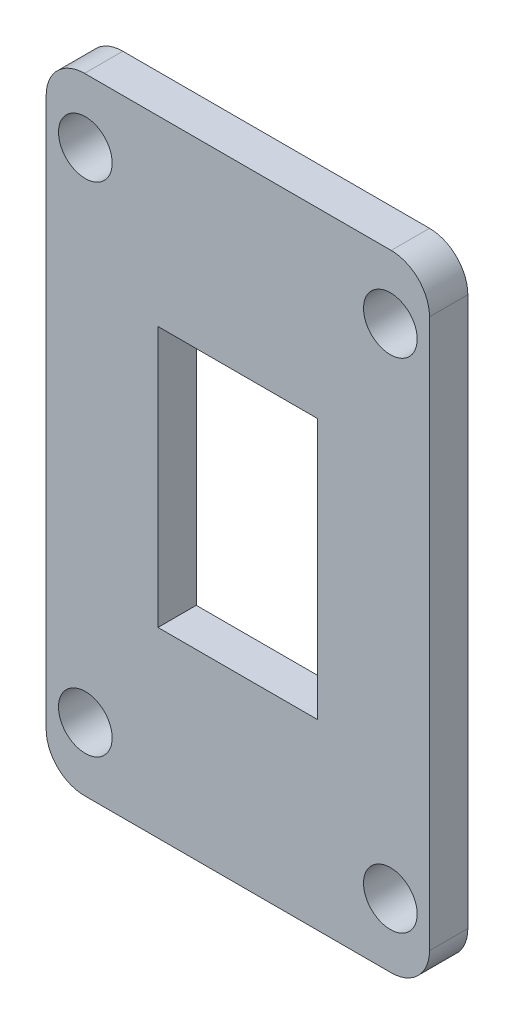
ISO-10303-21;
HEADER;
FILE_DESCRIPTION(('STEP AP214'),'2;1');
FILE_NAME('part.step','',(''),(''),'','','');
FILE_SCHEMA(('AUTOMOTIVE_DESIGN { 1 0 10303 214 1 1 1 1 }'));
ENDSEC;
DATA;
#1=APPLICATION_CONTEXT('core data for automotive mechanical design processes');
#2=APPLICATION_PROTOCOL_DEFINITION('international standard','automotive_design',2000,#1);
#3=PRODUCT_CONTEXT('',#1,'mechanical');
#4=PRODUCT('Part','Part','',(#3));
#5=PRODUCT_RELATED_PRODUCT_CATEGORY('part','',(#4));
#6=PRODUCT_DEFINITION_FORMATION('','',#4);
#7=PRODUCT_DEFINITION_CONTEXT('part definition',#1,'design');
#8=PRODUCT_DEFINITION('design','',#6,#7);
#9=PRODUCT_DEFINITION_SHAPE('','',#8);
#10=(LENGTH_UNIT() NAMED_UNIT(*) SI_UNIT(.MILLI.,.METRE.));
#11=(NAMED_UNIT(*) PLANE_ANGLE_UNIT() SI_UNIT($,.RADIAN.));
#12=(NAMED_UNIT(*) SI_UNIT($,.STERADIAN.) SOLID_ANGLE_UNIT());
#13=UNCERTAINTY_MEASURE_WITH_UNIT(LENGTH_MEASURE(1.E-05),#10,'distance_accuracy_value','');
#14=(GEOMETRIC_REPRESENTATION_CONTEXT(3) GLOBAL_UNCERTAINTY_ASSIGNED_CONTEXT((#13)) GLOBAL_UNIT_ASSIGNED_CONTEXT((#10,
#11,#12)) REPRESENTATION_CONTEXT('',''));
#15=CARTESIAN_POINT('',(0.,0.,0.));
#16=DIRECTION('',(0.,0.,1.));
#17=DIRECTION('',(1.,0.,0.));
#18=AXIS2_PLACEMENT_3D('',#15,#16,#17);
#19=CARTESIAN_POINT('',(0.,0.,3.));
#20=DIRECTION('',(0.,0.,1.));
#21=DIRECTION('',(1.,0.,0.));
#22=AXIS2_PLACEMENT_3D('',#19,#20,#21);
#23=PLANE('',#22);
#24=CARTESIAN_POINT('',(11.9362745098039,-19.48,3.));
#25=DIRECTION('',(0.,0.,1.));
#26=DIRECTION('',(1.,0.,0.));
#27=AXIS2_PLACEMENT_3D('',#24,#25,#26);
#28=CIRCLE('',#27,2.1);
#29=CARTESIAN_POINT('',(14.0362745098039,-19.48,3.));
#30=VERTEX_POINT('',#29);
#31=EDGE_CURVE('E425',#30,#30,#28,.T.);
#32=ORIENTED_EDGE('',*,*,#31,.F.);
#33=EDGE_LOOP('',(#32));
#34=FACE_BOUND('',#33,.T.);
#35=CARTESIAN_POINT('',(-11.9362745098039,19.48,3.));
#36=DIRECTION('',(0.,0.,1.));
#37=DIRECTION('',(1.,0.,0.));
#38=AXIS2_PLACEMENT_3D('',#35,#36,#37);
#39=CIRCLE('',#38,2.1);
#40=CARTESIAN_POINT('',(-9.83627450980392,19.48,3.));
#41=VERTEX_POINT('',#40);
#42=EDGE_CURVE('E157',#41,#41,#39,.T.);
#43=ORIENTED_EDGE('',*,*,#42,.F.);
#44=EDGE_LOOP('',(#43));
#45=FACE_BOUND('',#44,.T.);
#46=DIRECTION('',(-1.,0.,0.));
#47=VECTOR('',#46,1.);
#48=CARTESIAN_POINT('',(-15.,24.48,3.));
#49=LINE('',#48,#47);
#50=CARTESIAN_POINT('',(12.,24.48,3.));
#51=VERTEX_POINT('',#50);
#52=CARTESIAN_POINT('',(-12.,24.48,3.));
#53=VERTEX_POINT('',#52);
#54=EDGE_CURVE('E171',#51,#53,#49,.T.);
#55=ORIENTED_EDGE('',*,*,#54,.T.);
#56=CARTESIAN_POINT('',(-12.,21.48,3.));
#57=DIRECTION('',(0.,0.,1.));
#58=DIRECTION('',(1.,0.,0.));
#59=AXIS2_PLACEMENT_3D('',#56,#57,#58);
#60=CIRCLE('',#59,3.);
#61=CARTESIAN_POINT('',(-15.,21.48,3.));
#62=VERTEX_POINT('',#61);
#63=EDGE_CURVE('E211',#53,#62,#60,.T.);
#64=ORIENTED_EDGE('',*,*,#63,.T.);
#65=DIRECTION('',(0.,-1.,0.));
#66=VECTOR('',#65,1.);
#67=CARTESIAN_POINT('',(-15.,24.48,3.));
#68=LINE('',#67,#66);
#69=CARTESIAN_POINT('',(-15.,-21.48,3.));
#70=VERTEX_POINT('',#69);
#71=EDGE_CURVE('E175',#62,#70,#68,.T.);
#72=ORIENTED_EDGE('',*,*,#71,.T.);
#73=CARTESIAN_POINT('',(-12.,-21.48,3.));
#74=DIRECTION('',(0.,0.,1.));
#75=DIRECTION('',(1.,0.,0.));
#76=AXIS2_PLACEMENT_3D('',#73,#74,#75);
#77=CIRCLE('',#76,3.);
#78=CARTESIAN_POINT('',(-12.,-24.48,3.));
#79=VERTEX_POINT('',#78);
#80=EDGE_CURVE('E54',#70,#79,#77,.T.);
#81=ORIENTED_EDGE('',*,*,#80,.T.);
#82=DIRECTION('',(1.,0.,0.));
#83=VECTOR('',#82,1.);
#84=CARTESIAN_POINT('',(-15.,-24.48,3.));
#85=LINE('',#84,#83);
#86=CARTESIAN_POINT('',(12.,-24.48,3.));
#87=VERTEX_POINT('',#86);
#88=EDGE_CURVE('E177',#79,#87,#85,.T.);
#89=ORIENTED_EDGE('',*,*,#88,.T.);
#90=CARTESIAN_POINT('',(12.,-21.48,3.));
#91=DIRECTION('',(0.,0.,1.));
#92=DIRECTION('',(1.,0.,0.));
#93=AXIS2_PLACEMENT_3D('',#90,#91,#92);
#94=CIRCLE('',#93,3.);
#95=CARTESIAN_POINT('',(15.,-21.48,3.));
#96=VERTEX_POINT('',#95);
#97=EDGE_CURVE('E208',#87,#96,#94,.T.);
#98=ORIENTED_EDGE('',*,*,#97,.T.);
#99=DIRECTION('',(0.,1.,0.));
#100=VECTOR('',#99,1.);
#101=CARTESIAN_POINT('',(15.,24.48,3.));
#102=LINE('',#101,#100);
#103=CARTESIAN_POINT('',(15.,21.48,3.));
#104=VERTEX_POINT('',#103);
#105=EDGE_CURVE('E168',#96,#104,#102,.T.);
#106=ORIENTED_EDGE('',*,*,#105,.T.);
#107=CARTESIAN_POINT('',(12.,21.48,3.));
#108=DIRECTION('',(0.,0.,1.));
#109=DIRECTION('',(1.,0.,0.));
#110=AXIS2_PLACEMENT_3D('',#107,#108,#109);
#111=CIRCLE('',#110,3.);
#112=EDGE_CURVE('E206',#104,#51,#111,.T.);
#113=ORIENTED_EDGE('',*,*,#112,.T.);
#114=EDGE_LOOP('',(#55,#64,#72,#81,#89,#98,#106,#113));
#115=FACE_BOUND('',#114,.T.);
#116=DIRECTION('',(-1.,0.,0.));
#117=VECTOR('',#116,1.);
#118=CARTESIAN_POINT('',(-6.24999999999999,10.2,3.));
#119=LINE('',#118,#117);
#120=CARTESIAN_POINT('',(6.25000000000001,10.2,3.));
#121=VERTEX_POINT('',#120);
#122=CARTESIAN_POINT('',(-6.24999999999999,10.2,3.));
#123=VERTEX_POINT('',#122);
#124=EDGE_CURVE('E134',#121,#123,#119,.T.);
#125=ORIENTED_EDGE('',*,*,#124,.F.);
#126=DIRECTION('',(0.,1.,0.));
#127=VECTOR('',#126,1.);
#128=CARTESIAN_POINT('',(6.25000000000001,10.2,3.));
#129=LINE('',#128,#127);
#130=CARTESIAN_POINT('',(6.25000000000001,-10.2,3.));
#131=VERTEX_POINT('',#130);
#132=EDGE_CURVE('E124',#131,#121,#129,.T.);
#133=ORIENTED_EDGE('',*,*,#132,.F.);
#134=DIRECTION('',(1.,0.,0.));
#135=VECTOR('',#134,1.);
#136=CARTESIAN_POINT('',(-6.24999999999999,-10.2,3.));
#137=LINE('',#136,#135);
#138=CARTESIAN_POINT('',(-6.24999999999999,-10.2,3.));
#139=VERTEX_POINT('',#138);
#140=EDGE_CURVE('E150',#139,#131,#137,.T.);
#141=ORIENTED_EDGE('',*,*,#140,.F.);
#142=DIRECTION('',(0.,-1.,0.));
#143=VECTOR('',#142,1.);
#144=CARTESIAN_POINT('',(-6.24999999999999,10.2,3.));
#145=LINE('',#144,#143);
#146=EDGE_CURVE('E148',#123,#139,#145,.T.);
#147=ORIENTED_EDGE('',*,*,#146,.F.);
#148=EDGE_LOOP('',(#125,#133,#141,#147));
#149=FACE_BOUND('',#148,.T.);
#150=CARTESIAN_POINT('',(11.9362745098039,19.48,3.));
#151=DIRECTION('',(0.,0.,1.));
#152=DIRECTION('',(1.,0.,0.));
#153=AXIS2_PLACEMENT_3D('',#150,#151,#152);
#154=CIRCLE('',#153,2.1);
#155=CARTESIAN_POINT('',(14.0362745098039,19.48,3.));
#156=VERTEX_POINT('',#155);
#157=EDGE_CURVE('E430',#156,#156,#154,.T.);
#158=ORIENTED_EDGE('',*,*,#157,.F.);
#159=EDGE_LOOP('',(#158));
#160=FACE_BOUND('',#159,.T.);
#161=CARTESIAN_POINT('',(-11.9362745098039,-19.48,3.));
#162=DIRECTION('',(0.,0.,1.));
#163=DIRECTION('',(1.,0.,0.));
#164=AXIS2_PLACEMENT_3D('',#161,#162,#163);
#165=CIRCLE('',#164,2.09999999999999);
#166=CARTESIAN_POINT('',(-9.83627450980392,-19.48,3.));
#167=VERTEX_POINT('',#166);
#168=EDGE_CURVE('E420',#167,#167,#165,.T.);
#169=ORIENTED_EDGE('',*,*,#168,.F.);
#170=EDGE_LOOP('',(#169));
#171=FACE_BOUND('',#170,.T.);
#172=ADVANCED_FACE('F32',(#34,#45,#115,#149,#160,#171),#23,.T.);
#173=CARTESIAN_POINT('',(0.,0.,0.));
#174=DIRECTION('',(0.,0.,1.));
#175=DIRECTION('',(1.,0.,0.));
#176=AXIS2_PLACEMENT_3D('',#173,#174,#175);
#177=PLANE('',#176);
#178=CARTESIAN_POINT('',(11.9362745098039,-19.48,0.));
#179=DIRECTION('',(0.,0.,1.));
#180=DIRECTION('',(1.,0.,0.));
#181=AXIS2_PLACEMENT_3D('',#178,#179,#180);
#182=CIRCLE('',#181,2.1);
#183=CARTESIAN_POINT('',(14.0362745098039,-19.48,0.));
#184=VERTEX_POINT('',#183);
#185=EDGE_CURVE('E422',#184,#184,#182,.T.);
#186=ORIENTED_EDGE('',*,*,#185,.T.);
#187=EDGE_LOOP('',(#186));
#188=FACE_BOUND('',#187,.T.);
#189=CARTESIAN_POINT('',(-11.9362745098039,19.48,0.));
#190=DIRECTION('',(0.,0.,1.));
#191=DIRECTION('',(1.,0.,0.));
#192=AXIS2_PLACEMENT_3D('',#189,#190,#191);
#193=CIRCLE('',#192,2.1);
#194=CARTESIAN_POINT('',(-9.83627450980392,19.48,0.));
#195=VERTEX_POINT('',#194);
#196=EDGE_CURVE('E433',#195,#195,#193,.T.);
#197=ORIENTED_EDGE('',*,*,#196,.T.);
#198=EDGE_LOOP('',(#197));
#199=FACE_BOUND('',#198,.T.);
#200=DIRECTION('',(0.,-1.,0.));
#201=VECTOR('',#200,1.);
#202=CARTESIAN_POINT('',(-15.,24.48,0.));
#203=LINE('',#202,#201);
#204=CARTESIAN_POINT('',(-15.,21.48,0.));
#205=VERTEX_POINT('',#204);
#206=CARTESIAN_POINT('',(-15.,-21.48,0.));
#207=VERTEX_POINT('',#206);
#208=EDGE_CURVE('E185',#205,#207,#203,.T.);
#209=ORIENTED_EDGE('',*,*,#208,.F.);
#210=CARTESIAN_POINT('',(-12.,21.48,0.));
#211=DIRECTION('',(0.,0.,1.));
#212=DIRECTION('',(1.,0.,0.));
#213=AXIS2_PLACEMENT_3D('',#210,#211,#212);
#214=CIRCLE('',#213,3.);
#215=CARTESIAN_POINT('',(-12.,24.48,0.));
#216=VERTEX_POINT('',#215);
#217=EDGE_CURVE('E199',#205,#216,#214,.F.);
#218=ORIENTED_EDGE('',*,*,#217,.T.);
#219=DIRECTION('',(-1.,0.,0.));
#220=VECTOR('',#219,1.);
#221=CARTESIAN_POINT('',(-15.,24.48,0.));
#222=LINE('',#221,#220);
#223=CARTESIAN_POINT('',(12.,24.48,0.));
#224=VERTEX_POINT('',#223);
#225=EDGE_CURVE('E182',#224,#216,#222,.T.);
#226=ORIENTED_EDGE('',*,*,#225,.F.);
#227=CARTESIAN_POINT('',(12.,21.48,0.));
#228=DIRECTION('',(0.,0.,1.));
#229=DIRECTION('',(1.,0.,0.));
#230=AXIS2_PLACEMENT_3D('',#227,#228,#229);
#231=CIRCLE('',#230,3.);
#232=CARTESIAN_POINT('',(15.,21.48,0.));
#233=VERTEX_POINT('',#232);
#234=EDGE_CURVE('E193',#224,#233,#231,.F.);
#235=ORIENTED_EDGE('',*,*,#234,.T.);
#236=DIRECTION('',(0.,1.,0.));
#237=VECTOR('',#236,1.);
#238=CARTESIAN_POINT('',(15.,24.48,0.));
#239=LINE('',#238,#237);
#240=CARTESIAN_POINT('',(15.,-21.48,0.));
#241=VERTEX_POINT('',#240);
#242=EDGE_CURVE('E142',#241,#233,#239,.T.);
#243=ORIENTED_EDGE('',*,*,#242,.F.);
#244=CARTESIAN_POINT('',(12.,-21.48,0.));
#245=DIRECTION('',(0.,0.,1.));
#246=DIRECTION('',(1.,0.,0.));
#247=AXIS2_PLACEMENT_3D('',#244,#245,#246);
#248=CIRCLE('',#247,3.);
#249=CARTESIAN_POINT('',(12.,-24.48,0.));
#250=VERTEX_POINT('',#249);
#251=EDGE_CURVE('E195',#241,#250,#248,.F.);
#252=ORIENTED_EDGE('',*,*,#251,.T.);
#253=DIRECTION('',(1.,0.,0.));
#254=VECTOR('',#253,1.);
#255=CARTESIAN_POINT('',(-15.,-24.48,0.));
#256=LINE('',#255,#254);
#257=CARTESIAN_POINT('',(-12.,-24.48,0.));
#258=VERTEX_POINT('',#257);
#259=EDGE_CURVE('E172',#258,#250,#256,.T.);
#260=ORIENTED_EDGE('',*,*,#259,.F.);
#261=CARTESIAN_POINT('',(-12.,-21.48,0.));
#262=DIRECTION('',(0.,0.,1.));
#263=DIRECTION('',(1.,0.,0.));
#264=AXIS2_PLACEMENT_3D('',#261,#262,#263);
#265=CIRCLE('',#264,3.);
#266=EDGE_CURVE('E197',#258,#207,#265,.F.);
#267=ORIENTED_EDGE('',*,*,#266,.T.);
#268=EDGE_LOOP('',(#209,#218,#226,#235,#243,#252,#260,#267));
#269=FACE_BOUND('',#268,.T.);
#270=DIRECTION('',(0.,1.,0.));
#271=VECTOR('',#270,1.);
#272=CARTESIAN_POINT('',(6.25000000000001,10.2,0.));
#273=LINE('',#272,#271);
#274=CARTESIAN_POINT('',(6.25000000000001,-10.2,0.));
#275=VERTEX_POINT('',#274);
#276=CARTESIAN_POINT('',(6.25000000000001,10.2,0.));
#277=VERTEX_POINT('',#276);
#278=EDGE_CURVE('E155',#275,#277,#273,.T.);
#279=ORIENTED_EDGE('',*,*,#278,.T.);
#280=DIRECTION('',(-1.,0.,0.));
#281=VECTOR('',#280,1.);
#282=CARTESIAN_POINT('',(-6.24999999999999,10.2,0.));
#283=LINE('',#282,#281);
#284=CARTESIAN_POINT('',(-6.24999999999999,10.2,0.));
#285=VERTEX_POINT('',#284);
#286=EDGE_CURVE('E141',#277,#285,#283,.T.);
#287=ORIENTED_EDGE('',*,*,#286,.T.);
#288=DIRECTION('',(0.,-1.,0.));
#289=VECTOR('',#288,1.);
#290=CARTESIAN_POINT('',(-6.24999999999999,10.2,0.));
#291=LINE('',#290,#289);
#292=CARTESIAN_POINT('',(-6.24999999999999,-10.2,0.));
#293=VERTEX_POINT('',#292);
#294=EDGE_CURVE('E159',#285,#293,#291,.T.);
#295=ORIENTED_EDGE('',*,*,#294,.T.);
#296=DIRECTION('',(1.,0.,0.));
#297=VECTOR('',#296,1.);
#298=CARTESIAN_POINT('',(-6.24999999999999,-10.2,0.));
#299=LINE('',#298,#297);
#300=EDGE_CURVE('E135',#293,#275,#299,.T.);
#301=ORIENTED_EDGE('',*,*,#300,.T.);
#302=EDGE_LOOP('',(#279,#287,#295,#301));
#303=FACE_BOUND('',#302,.T.);
#304=CARTESIAN_POINT('',(11.9362745098039,19.48,0.));
#305=DIRECTION('',(0.,0.,1.));
#306=DIRECTION('',(1.,0.,0.));
#307=AXIS2_PLACEMENT_3D('',#304,#305,#306);
#308=CIRCLE('',#307,2.1);
#309=CARTESIAN_POINT('',(14.0362745098039,19.48,0.));
#310=VERTEX_POINT('',#309);
#311=EDGE_CURVE('E416',#310,#310,#308,.T.);
#312=ORIENTED_EDGE('',*,*,#311,.T.);
#313=EDGE_LOOP('',(#312));
#314=FACE_BOUND('',#313,.T.);
#315=CARTESIAN_POINT('',(-11.9362745098039,-19.48,0.));
#316=DIRECTION('',(0.,0.,1.));
#317=DIRECTION('',(1.,0.,0.));
#318=AXIS2_PLACEMENT_3D('',#315,#316,#317);
#319=CIRCLE('',#318,2.09999999999999);
#320=CARTESIAN_POINT('',(-9.83627450980392,-19.48,0.));
#321=VERTEX_POINT('',#320);
#322=EDGE_CURVE('E419',#321,#321,#319,.T.);
#323=ORIENTED_EDGE('',*,*,#322,.T.);
#324=EDGE_LOOP('',(#323));
#325=FACE_BOUND('',#324,.T.);
#326=ADVANCED_FACE('F233',(#188,#199,#269,#303,#314,#325),#177,.F.);
#327=CARTESIAN_POINT('',(15.,24.48,3.));
#328=DIRECTION('',(-1.,0.,0.));
#329=DIRECTION('',(0.,0.,1.));
#330=AXIS2_PLACEMENT_3D('',#327,#328,#329);
#331=PLANE('',#330);
#332=ORIENTED_EDGE('',*,*,#105,.F.);
#333=DIRECTION('',(0.,0.,-1.));
#334=VECTOR('',#333,1.);
#335=CARTESIAN_POINT('',(15.,-21.48,3.));
#336=LINE('',#335,#334);
#337=EDGE_CURVE('E11',#96,#241,#336,.T.);
#338=ORIENTED_EDGE('',*,*,#337,.T.);
#339=ORIENTED_EDGE('',*,*,#242,.T.);
#340=DIRECTION('',(0.,0.,-1.));
#341=VECTOR('',#340,1.);
#342=CARTESIAN_POINT('',(15.,21.48,3.));
#343=LINE('',#342,#341);
#344=EDGE_CURVE('E40',#233,#104,#343,.F.);
#345=ORIENTED_EDGE('',*,*,#344,.T.);
#346=EDGE_LOOP('',(#332,#338,#339,#345));
#347=FACE_BOUND('',#346,.T.);
#348=ADVANCED_FACE('F219',(#347),#331,.F.);
#349=CARTESIAN_POINT('',(-15.,24.48,3.));
#350=DIRECTION('',(0.,-1.,0.));
#351=DIRECTION('',(0.,0.,-1.));
#352=AXIS2_PLACEMENT_3D('',#349,#350,#351);
#353=PLANE('',#352);
#354=ORIENTED_EDGE('',*,*,#225,.T.);
#355=DIRECTION('',(0.,0.,-1.));
#356=VECTOR('',#355,1.);
#357=CARTESIAN_POINT('',(-12.,24.48,3.));
#358=LINE('',#357,#356);
#359=EDGE_CURVE('E204',#216,#53,#358,.F.);
#360=ORIENTED_EDGE('',*,*,#359,.T.);
#361=ORIENTED_EDGE('',*,*,#54,.F.);
#362=DIRECTION('',(0.,0.,-1.));
#363=VECTOR('',#362,1.);
#364=CARTESIAN_POINT('',(12.,24.48,3.));
#365=LINE('',#364,#363);
#366=EDGE_CURVE('E201',#51,#224,#365,.T.);
#367=ORIENTED_EDGE('',*,*,#366,.T.);
#368=EDGE_LOOP('',(#354,#360,#361,#367));
#369=FACE_BOUND('',#368,.T.);
#370=ADVANCED_FACE('F229',(#369),#353,.F.);
#371=CARTESIAN_POINT('',(-15.,24.48,3.));
#372=DIRECTION('',(1.,0.,0.));
#373=DIRECTION('',(0.,0.,-1.));
#374=AXIS2_PLACEMENT_3D('',#371,#372,#373);
#375=PLANE('',#374);
#376=ORIENTED_EDGE('',*,*,#71,.F.);
#377=DIRECTION('',(0.,0.,-1.));
#378=VECTOR('',#377,1.);
#379=CARTESIAN_POINT('',(-15.,21.48,3.));
#380=LINE('',#379,#378);
#381=EDGE_CURVE('E190',#62,#205,#380,.T.);
#382=ORIENTED_EDGE('',*,*,#381,.T.);
#383=ORIENTED_EDGE('',*,*,#208,.T.);
#384=DIRECTION('',(0.,0.,-1.));
#385=VECTOR('',#384,1.);
#386=CARTESIAN_POINT('',(-15.,-21.48,3.));
#387=LINE('',#386,#385);
#388=EDGE_CURVE('E179',#207,#70,#387,.F.);
#389=ORIENTED_EDGE('',*,*,#388,.T.);
#390=EDGE_LOOP('',(#376,#382,#383,#389));
#391=FACE_BOUND('',#390,.T.);
#392=ADVANCED_FACE('F241',(#391),#375,.F.);
#393=CARTESIAN_POINT('',(-15.,-24.48,3.));
#394=DIRECTION('',(0.,1.,0.));
#395=DIRECTION('',(0.,0.,1.));
#396=AXIS2_PLACEMENT_3D('',#393,#394,#395);
#397=PLANE('',#396);
#398=ORIENTED_EDGE('',*,*,#88,.F.);
#399=DIRECTION('',(0.,0.,-1.));
#400=VECTOR('',#399,1.);
#401=CARTESIAN_POINT('',(-12.,-24.48,3.));
#402=LINE('',#401,#400);
#403=EDGE_CURVE('E214',#79,#258,#402,.T.);
#404=ORIENTED_EDGE('',*,*,#403,.T.);
#405=ORIENTED_EDGE('',*,*,#259,.T.);
#406=DIRECTION('',(0.,0.,-1.));
#407=VECTOR('',#406,1.);
#408=CARTESIAN_POINT('',(12.,-24.48,3.));
#409=LINE('',#408,#407);
#410=EDGE_CURVE('E47',#250,#87,#409,.F.);
#411=ORIENTED_EDGE('',*,*,#410,.T.);
#412=EDGE_LOOP('',(#398,#404,#405,#411));
#413=FACE_BOUND('',#412,.T.);
#414=ADVANCED_FACE('F247',(#413),#397,.F.);
#415=CARTESIAN_POINT('',(6.25000000000001,10.2,3.));
#416=DIRECTION('',(-1.,0.,0.));
#417=DIRECTION('',(0.,0.,1.));
#418=AXIS2_PLACEMENT_3D('',#415,#416,#417);
#419=PLANE('',#418);
#420=ORIENTED_EDGE('',*,*,#278,.F.);
#421=DIRECTION('',(0.,0.,-1.));
#422=VECTOR('',#421,1.);
#423=CARTESIAN_POINT('',(6.25000000000001,-10.2,3.));
#424=LINE('',#423,#422);
#425=EDGE_CURVE('E130',#131,#275,#424,.T.);
#426=ORIENTED_EDGE('',*,*,#425,.F.);
#427=ORIENTED_EDGE('',*,*,#132,.T.);
#428=DIRECTION('',(0.,0.,-1.));
#429=VECTOR('',#428,1.);
#430=CARTESIAN_POINT('',(6.25000000000001,10.2,3.));
#431=LINE('',#430,#429);
#432=EDGE_CURVE('E127',#121,#277,#431,.T.);
#433=ORIENTED_EDGE('',*,*,#432,.T.);
#434=EDGE_LOOP('',(#420,#426,#427,#433));
#435=FACE_BOUND('',#434,.T.);
#436=ADVANCED_FACE('F126',(#435),#419,.T.);
#437=CARTESIAN_POINT('',(-6.24999999999999,10.2,3.));
#438=DIRECTION('',(0.,-1.,0.));
#439=DIRECTION('',(0.,0.,-1.));
#440=AXIS2_PLACEMENT_3D('',#437,#438,#439);
#441=PLANE('',#440);
#442=ORIENTED_EDGE('',*,*,#286,.F.);
#443=ORIENTED_EDGE('',*,*,#432,.F.);
#444=ORIENTED_EDGE('',*,*,#124,.T.);
#445=DIRECTION('',(0.,0.,-1.));
#446=VECTOR('',#445,1.);
#447=CARTESIAN_POINT('',(-6.24999999999999,10.2,3.));
#448=LINE('',#447,#446);
#449=EDGE_CURVE('E143',#123,#285,#448,.T.);
#450=ORIENTED_EDGE('',*,*,#449,.T.);
#451=EDGE_LOOP('',(#442,#443,#444,#450));
#452=FACE_BOUND('',#451,.T.);
#453=ADVANCED_FACE('F138',(#452),#441,.T.);
#454=CARTESIAN_POINT('',(-6.24999999999999,10.2,3.));
#455=DIRECTION('',(1.,0.,0.));
#456=DIRECTION('',(0.,1.,0.));
#457=AXIS2_PLACEMENT_3D('',#454,#455,#456);
#458=PLANE('',#457);
#459=ORIENTED_EDGE('',*,*,#294,.F.);
#460=ORIENTED_EDGE('',*,*,#449,.F.);
#461=ORIENTED_EDGE('',*,*,#146,.T.);
#462=DIRECTION('',(0.,0.,-1.));
#463=VECTOR('',#462,1.);
#464=CARTESIAN_POINT('',(-6.24999999999999,-10.2,3.));
#465=LINE('',#464,#463);
#466=EDGE_CURVE('E165',#139,#293,#465,.T.);
#467=ORIENTED_EDGE('',*,*,#466,.T.);
#468=EDGE_LOOP('',(#459,#460,#461,#467));
#469=FACE_BOUND('',#468,.T.);
#470=ADVANCED_FACE('F304',(#469),#458,.T.);
#471=CARTESIAN_POINT('',(-6.24999999999999,-10.2,3.));
#472=DIRECTION('',(0.,1.,0.));
#473=DIRECTION('',(0.,0.,1.));
#474=AXIS2_PLACEMENT_3D('',#471,#472,#473);
#475=PLANE('',#474);
#476=ORIENTED_EDGE('',*,*,#300,.F.);
#477=ORIENTED_EDGE('',*,*,#466,.F.);
#478=ORIENTED_EDGE('',*,*,#140,.T.);
#479=ORIENTED_EDGE('',*,*,#425,.T.);
#480=EDGE_LOOP('',(#476,#477,#478,#479));
#481=FACE_BOUND('',#480,.T.);
#482=ADVANCED_FACE('F300',(#481),#475,.T.);
#483=CARTESIAN_POINT('',(-11.9362745098039,19.48,3.));
#484=DIRECTION('',(0.,0.,-1.));
#485=DIRECTION('',(-1.,0.,0.));
#486=AXIS2_PLACEMENT_3D('',#483,#484,#485);
#487=CYLINDRICAL_SURFACE('',#486,2.1);
#488=ORIENTED_EDGE('',*,*,#42,.T.);
#489=EDGE_LOOP('',(#488));
#490=FACE_BOUND('',#489,.T.);
#491=ORIENTED_EDGE('',*,*,#196,.F.);
#492=EDGE_LOOP('',(#491));
#493=FACE_BOUND('',#492,.T.);
#494=ADVANCED_FACE('F296',(#490,#493),#487,.F.);
#495=CARTESIAN_POINT('',(11.9362745098039,19.48,3.));
#496=DIRECTION('',(0.,0.,-1.));
#497=DIRECTION('',(-1.,0.,0.));
#498=AXIS2_PLACEMENT_3D('',#495,#496,#497);
#499=CYLINDRICAL_SURFACE('',#498,2.1);
#500=ORIENTED_EDGE('',*,*,#157,.T.);
#501=EDGE_LOOP('',(#500));
#502=FACE_BOUND('',#501,.T.);
#503=ORIENTED_EDGE('',*,*,#311,.F.);
#504=EDGE_LOOP('',(#503));
#505=FACE_BOUND('',#504,.T.);
#506=ADVANCED_FACE('F288',(#502,#505),#499,.F.);
#507=CARTESIAN_POINT('',(11.9362745098039,-19.48,3.));
#508=DIRECTION('',(0.,0.,-1.));
#509=DIRECTION('',(-1.,0.,0.));
#510=AXIS2_PLACEMENT_3D('',#507,#508,#509);
#511=CYLINDRICAL_SURFACE('',#510,2.1);
#512=ORIENTED_EDGE('',*,*,#31,.T.);
#513=EDGE_LOOP('',(#512));
#514=FACE_BOUND('',#513,.T.);
#515=ORIENTED_EDGE('',*,*,#185,.F.);
#516=EDGE_LOOP('',(#515));
#517=FACE_BOUND('',#516,.T.);
#518=ADVANCED_FACE('F282',(#514,#517),#511,.F.);
#519=CARTESIAN_POINT('',(-11.9362745098039,-19.48,3.));
#520=DIRECTION('',(0.,0.,-1.));
#521=DIRECTION('',(-1.,0.,0.));
#522=AXIS2_PLACEMENT_3D('',#519,#520,#521);
#523=CYLINDRICAL_SURFACE('',#522,2.09999999999999);
#524=ORIENTED_EDGE('',*,*,#168,.T.);
#525=EDGE_LOOP('',(#524));
#526=FACE_BOUND('',#525,.T.);
#527=ORIENTED_EDGE('',*,*,#322,.F.);
#528=EDGE_LOOP('',(#527));
#529=FACE_BOUND('',#528,.T.);
#530=ADVANCED_FACE('F278',(#526,#529),#523,.F.);
#531=CARTESIAN_POINT('',(-12.,21.48,3.));
#532=DIRECTION('',(0.,0.,-1.));
#533=DIRECTION('',(-1.,0.,0.));
#534=AXIS2_PLACEMENT_3D('',#531,#532,#533);
#535=CYLINDRICAL_SURFACE('',#534,3.);
#536=ORIENTED_EDGE('',*,*,#63,.F.);
#537=ORIENTED_EDGE('',*,*,#359,.F.);
#538=ORIENTED_EDGE('',*,*,#217,.F.);
#539=ORIENTED_EDGE('',*,*,#381,.F.);
#540=EDGE_LOOP('',(#536,#537,#538,#539));
#541=FACE_BOUND('',#540,.T.);
#542=ADVANCED_FACE('F238',(#541),#535,.T.);
#543=CARTESIAN_POINT('',(-12.,-21.48,3.));
#544=DIRECTION('',(0.,0.,-1.));
#545=DIRECTION('',(-1.,0.,0.));
#546=AXIS2_PLACEMENT_3D('',#543,#544,#545);
#547=CYLINDRICAL_SURFACE('',#546,3.);
#548=ORIENTED_EDGE('',*,*,#80,.F.);
#549=ORIENTED_EDGE('',*,*,#388,.F.);
#550=ORIENTED_EDGE('',*,*,#266,.F.);
#551=ORIENTED_EDGE('',*,*,#403,.F.);
#552=EDGE_LOOP('',(#548,#549,#550,#551));
#553=FACE_BOUND('',#552,.T.);
#554=ADVANCED_FACE('F245',(#553),#547,.T.);
#555=CARTESIAN_POINT('',(12.,-21.48,3.));
#556=DIRECTION('',(0.,0.,-1.));
#557=DIRECTION('',(-1.,0.,0.));
#558=AXIS2_PLACEMENT_3D('',#555,#556,#557);
#559=CYLINDRICAL_SURFACE('',#558,3.);
#560=ORIENTED_EDGE('',*,*,#97,.F.);
#561=ORIENTED_EDGE('',*,*,#410,.F.);
#562=ORIENTED_EDGE('',*,*,#251,.F.);
#563=ORIENTED_EDGE('',*,*,#337,.F.);
#564=EDGE_LOOP('',(#560,#561,#562,#563));
#565=FACE_BOUND('',#564,.T.);
#566=ADVANCED_FACE('F249',(#565),#559,.T.);
#567=CARTESIAN_POINT('',(12.,21.48,3.));
#568=DIRECTION('',(0.,0.,-1.));
#569=DIRECTION('',(-1.,0.,0.));
#570=AXIS2_PLACEMENT_3D('',#567,#568,#569);
#571=CYLINDRICAL_SURFACE('',#570,3.);
#572=ORIENTED_EDGE('',*,*,#112,.F.);
#573=ORIENTED_EDGE('',*,*,#344,.F.);
#574=ORIENTED_EDGE('',*,*,#234,.F.);
#575=ORIENTED_EDGE('',*,*,#366,.F.);
#576=EDGE_LOOP('',(#572,#573,#574,#575));
#577=FACE_BOUND('',#576,.T.);
#578=ADVANCED_FACE('F34',(#577),#571,.T.);
#579=CLOSED_SHELL('',(#172,#326,#348,#370,#392,#414,#436,#453,#470,#482,#494,#506,#518,#530,
#542,#554,#566,#578));
#580=MANIFOLD_SOLID_BREP('B2',#579);
#581=ADVANCED_BREP_SHAPE_REPRESENTATION('',(#18,#580),#14);
#582=SHAPE_DEFINITION_REPRESENTATION(#9,#581);
ENDSEC;
END-ISO-10303-21;
